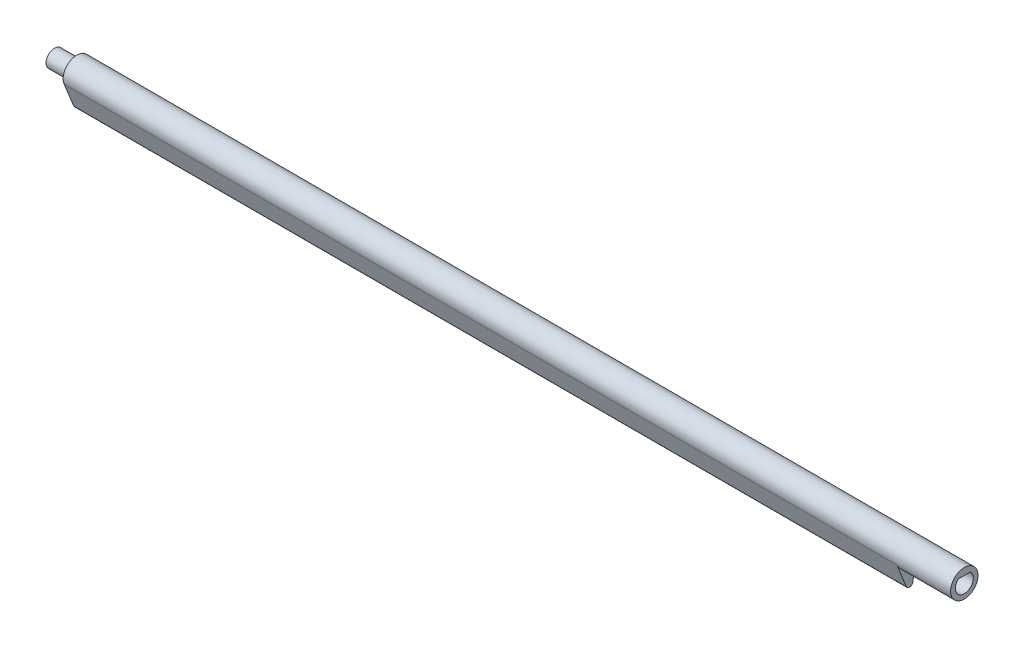
ISO-10303-21;
HEADER;
FILE_DESCRIPTION(('STEP AP214'),'2;1');
FILE_NAME('part.step','',(''),(''),'','','');
FILE_SCHEMA(('AUTOMOTIVE_DESIGN { 1 0 10303 214 1 1 1 1 }'));
ENDSEC;
DATA;
#1=APPLICATION_CONTEXT('core data for automotive mechanical design processes');
#2=APPLICATION_PROTOCOL_DEFINITION('international standard','automotive_design',2000,#1);
#3=PRODUCT_CONTEXT('',#1,'mechanical');
#4=PRODUCT('Part','Part','',(#3));
#5=PRODUCT_RELATED_PRODUCT_CATEGORY('part','',(#4));
#6=PRODUCT_DEFINITION_FORMATION('','',#4);
#7=PRODUCT_DEFINITION_CONTEXT('part definition',#1,'design');
#8=PRODUCT_DEFINITION('design','',#6,#7);
#9=PRODUCT_DEFINITION_SHAPE('','',#8);
#10=(LENGTH_UNIT() NAMED_UNIT(*) SI_UNIT(.MILLI.,.METRE.));
#11=(NAMED_UNIT(*) PLANE_ANGLE_UNIT() SI_UNIT($,.RADIAN.));
#12=(NAMED_UNIT(*) SI_UNIT($,.STERADIAN.) SOLID_ANGLE_UNIT());
#13=UNCERTAINTY_MEASURE_WITH_UNIT(LENGTH_MEASURE(1.E-05),#10,'distance_accuracy_value','');
#14=(GEOMETRIC_REPRESENTATION_CONTEXT(3) GLOBAL_UNCERTAINTY_ASSIGNED_CONTEXT((#13)) GLOBAL_UNIT_ASSIGNED_CONTEXT((#10,
#11,#12)) REPRESENTATION_CONTEXT('',''));
#15=CARTESIAN_POINT('',(0.,0.,0.));
#16=DIRECTION('',(0.,0.,1.));
#17=DIRECTION('',(1.,0.,0.));
#18=AXIS2_PLACEMENT_3D('',#15,#16,#17);
#19=CARTESIAN_POINT('',(121.5,8.00000000000002,0.));
#20=DIRECTION('',(-1.,0.,0.));
#21=DIRECTION('',(0.,0.,1.));
#22=AXIS2_PLACEMENT_3D('',#19,#20,#21);
#23=PLANE('',#22);
#24=CARTESIAN_POINT('',(121.5,8.00000000000002,0.));
#25=DIRECTION('',(-1.,0.,0.));
#26=DIRECTION('',(0.,0.,1.));
#27=AXIS2_PLACEMENT_3D('',#24,#25,#26);
#28=CIRCLE('',#27,2.625);
#29=CARTESIAN_POINT('',(121.5,9.975,1.72916164657908));
#30=VERTEX_POINT('',#29);
#31=CARTESIAN_POINT('',(121.5,9.975,-1.72916164657907));
#32=VERTEX_POINT('',#31);
#33=EDGE_CURVE('E20',#30,#32,#28,.F.);
#34=ORIENTED_EDGE('',*,*,#33,.T.);
#35=DIRECTION('',(0.,0.,-1.));
#36=VECTOR('',#35,1.);
#37=CARTESIAN_POINT('',(121.5,9.975,0.));
#38=LINE('',#37,#36);
#39=EDGE_CURVE('E92',#30,#32,#38,.T.);
#40=ORIENTED_EDGE('',*,*,#39,.F.);
#41=EDGE_LOOP('',(#34,#40));
#42=FACE_BOUND('',#41,.T.);
#43=ADVANCED_FACE('F17',(#42),#23,.F.);
#44=CARTESIAN_POINT('',(-128.,8.00000000000002,0.));
#45=DIRECTION('',(-1.,0.,0.));
#46=DIRECTION('',(0.,0.,1.));
#47=AXIS2_PLACEMENT_3D('',#44,#45,#46);
#48=PLANE('',#47);
#49=CARTESIAN_POINT('',(-128.,8.00000000000002,0.));
#50=DIRECTION('',(1.,0.,0.));
#51=DIRECTION('',(0.,0.,-1.));
#52=AXIS2_PLACEMENT_3D('',#49,#50,#51);
#53=CIRCLE('',#52,2.5);
#54=CARTESIAN_POINT('',(-128.,8.00000000000002,-2.49999999999999));
#55=VERTEX_POINT('',#54);
#56=EDGE_CURVE('E91',#55,#55,#53,.T.);
#57=ORIENTED_EDGE('',*,*,#56,.F.);
#58=EDGE_LOOP('',(#57));
#59=FACE_BOUND('',#58,.T.);
#60=ADVANCED_FACE('F239',(#59),#48,.T.);
#61=CARTESIAN_POINT('',(117.981122338017,9.975,0.));
#62=DIRECTION('',(0.,-1.,0.));
#63=DIRECTION('',(0.,0.,-1.));
#64=AXIS2_PLACEMENT_3D('',#61,#62,#63);
#65=PLANE('',#64);
#66=DIRECTION('',(-1.,0.,0.));
#67=VECTOR('',#66,1.);
#68=CARTESIAN_POINT('',(137.5,9.97500000000001,-1.72916164657907));
#69=LINE('',#68,#67);
#70=CARTESIAN_POINT('',(137.5,9.975,-1.72916164657907));
#71=VERTEX_POINT('',#70);
#72=EDGE_CURVE('E90',#32,#71,#69,.F.);
#73=ORIENTED_EDGE('',*,*,#72,.T.);
#74=DIRECTION('',(0.,0.,-1.));
#75=VECTOR('',#74,1.);
#76=CARTESIAN_POINT('',(137.5,9.975,0.));
#77=LINE('',#76,#75);
#78=CARTESIAN_POINT('',(137.5,9.975,1.72916164657908));
#79=VERTEX_POINT('',#78);
#80=EDGE_CURVE('E97',#79,#71,#77,.T.);
#81=ORIENTED_EDGE('',*,*,#80,.F.);
#82=DIRECTION('',(1.,0.,0.));
#83=VECTOR('',#82,1.);
#84=CARTESIAN_POINT('',(117.981122338017,9.975,1.72916164657907));
#85=LINE('',#84,#83);
#86=EDGE_CURVE('E87',#79,#30,#85,.F.);
#87=ORIENTED_EDGE('',*,*,#86,.T.);
#88=ORIENTED_EDGE('',*,*,#39,.T.);
#89=EDGE_LOOP('',(#73,#81,#87,#88));
#90=FACE_BOUND('',#89,.T.);
#91=ADVANCED_FACE('F95',(#90),#65,.T.);
#92=CARTESIAN_POINT('',(137.5,8.00000000000002,0.));
#93=DIRECTION('',(-1.,0.,0.));
#94=DIRECTION('',(0.,0.,1.));
#95=AXIS2_PLACEMENT_3D('',#92,#93,#94);
#96=CYLINDRICAL_SURFACE('',#95,2.625);
#97=CARTESIAN_POINT('',(137.5,8.00000000000002,0.));
#98=DIRECTION('',(-1.,0.,0.));
#99=DIRECTION('',(0.,0.,1.));
#100=AXIS2_PLACEMENT_3D('',#97,#98,#99);
#101=CIRCLE('',#100,2.625);
#102=EDGE_CURVE('E146',#71,#79,#101,.T.);
#103=ORIENTED_EDGE('',*,*,#102,.F.);
#104=ORIENTED_EDGE('',*,*,#72,.F.);
#105=ORIENTED_EDGE('',*,*,#33,.F.);
#106=ORIENTED_EDGE('',*,*,#86,.F.);
#107=EDGE_LOOP('',(#103,#104,#105,#106));
#108=FACE_BOUND('',#107,.T.);
#109=ADVANCED_FACE('F85',(#108),#96,.F.);
#110=CARTESIAN_POINT('',(-128.,8.00000000000002,0.));
#111=DIRECTION('',(1.,0.,0.));
#112=DIRECTION('',(0.,0.,-1.));
#113=AXIS2_PLACEMENT_3D('',#110,#111,#112);
#114=CYLINDRICAL_SURFACE('',#113,2.5);
#115=CARTESIAN_POINT('',(-121.5,8.00000000000002,0.));
#116=DIRECTION('',(1.,0.,0.));
#117=DIRECTION('',(0.,0.,-1.));
#118=AXIS2_PLACEMENT_3D('',#115,#116,#117);
#119=CIRCLE('',#118,2.5);
#120=CARTESIAN_POINT('',(-121.5,8.00000000000002,-2.49999999999999));
#121=VERTEX_POINT('',#120);
#122=EDGE_CURVE('E183',#121,#121,#119,.T.);
#123=ORIENTED_EDGE('',*,*,#122,.F.);
#124=EDGE_LOOP('',(#123));
#125=FACE_BOUND('',#124,.T.);
#126=ORIENTED_EDGE('',*,*,#56,.T.);
#127=EDGE_LOOP('',(#126));
#128=FACE_BOUND('',#127,.T.);
#129=ADVANCED_FACE('F225',(#125,#128),#114,.T.);
#130=CARTESIAN_POINT('',(121.5,0.,0.));
#131=DIRECTION('',(-1.,0.,0.));
#132=DIRECTION('',(0.,0.,1.));
#133=AXIS2_PLACEMENT_3D('',#130,#131,#132);
#134=CYLINDRICAL_SURFACE('',#133,1.);
#135=CARTESIAN_POINT('',(121.5,0.,0.));
#136=DIRECTION('',(-1.,0.,0.));
#137=DIRECTION('',(0.,0.,1.));
#138=AXIS2_PLACEMENT_3D('',#135,#136,#137);
#139=CIRCLE('',#138,1.);
#140=CARTESIAN_POINT('',(121.5,-0.155855908360178,-0.987779801286301));
#141=VERTEX_POINT('',#140);
#142=CARTESIAN_POINT('',(121.5,-0.375000000000003,0.927024810886965));
#143=VERTEX_POINT('',#142);
#144=EDGE_CURVE('E163',#141,#143,#139,.T.);
#145=ORIENTED_EDGE('',*,*,#144,.T.);
#146=DIRECTION('',(1.,0.,0.));
#147=VECTOR('',#146,1.);
#148=CARTESIAN_POINT('',(121.5,-0.375000000000005,0.92702481088697));
#149=LINE('',#148,#147);
#150=CARTESIAN_POINT('',(-121.5,-0.375000000000003,0.927024810886965));
#151=VERTEX_POINT('',#150);
#152=EDGE_CURVE('E173',#143,#151,#149,.F.);
#153=ORIENTED_EDGE('',*,*,#152,.T.);
#154=CARTESIAN_POINT('',(-121.5,0.,0.));
#155=DIRECTION('',(-1.,0.,0.));
#156=DIRECTION('',(0.,0.,1.));
#157=AXIS2_PLACEMENT_3D('',#154,#155,#156);
#158=CIRCLE('',#157,1.);
#159=CARTESIAN_POINT('',(-121.5,-0.155855908360177,-0.987779801286307));
#160=VERTEX_POINT('',#159);
#161=EDGE_CURVE('E168',#160,#151,#158,.T.);
#162=ORIENTED_EDGE('',*,*,#161,.F.);
#163=DIRECTION('',(1.,0.,0.));
#164=VECTOR('',#163,1.);
#165=CARTESIAN_POINT('',(121.5,-0.155855908360174,-0.987779801286301));
#166=LINE('',#165,#164);
#167=EDGE_CURVE('E160',#160,#141,#166,.T.);
#168=ORIENTED_EDGE('',*,*,#167,.T.);
#169=EDGE_LOOP('',(#145,#153,#162,#168));
#170=FACE_BOUND('',#169,.T.);
#171=ADVANCED_FACE('F223',(#170),#134,.T.);
#172=CARTESIAN_POINT('',(121.5,6.49999999999999,3.70809924354784));
#173=DIRECTION('',(0.,0.375,-0.927024810886958));
#174=DIRECTION('',(0.,0.927024810886958,0.375));
#175=AXIS2_PLACEMENT_3D('',#172,#173,#174);
#176=PLANE('',#175);
#177=ORIENTED_EDGE('',*,*,#152,.F.);
#178=DIRECTION('',(0.,0.927024810886957,0.375000000000001));
#179=VECTOR('',#178,1.);
#180=CARTESIAN_POINT('',(121.5,-0.375,0.92702481088696));
#181=LINE('',#180,#179);
#182=CARTESIAN_POINT('',(121.5,6.5,3.70809924354784));
#183=VERTEX_POINT('',#182);
#184=EDGE_CURVE('E161',#143,#183,#181,.T.);
#185=ORIENTED_EDGE('',*,*,#184,.T.);
#186=DIRECTION('',(-1.,0.,0.));
#187=VECTOR('',#186,1.);
#188=CARTESIAN_POINT('',(121.5,6.5,3.70809924354783));
#189=LINE('',#188,#187);
#190=CARTESIAN_POINT('',(-121.5,6.5,3.70809924354784));
#191=VERTEX_POINT('',#190);
#192=EDGE_CURVE('E164',#191,#183,#189,.F.);
#193=ORIENTED_EDGE('',*,*,#192,.F.);
#194=DIRECTION('',(0.,0.927024810886957,0.375000000000001));
#195=VECTOR('',#194,1.);
#196=CARTESIAN_POINT('',(-121.5,-0.375,0.92702481088696));
#197=LINE('',#196,#195);
#198=EDGE_CURVE('E186',#151,#191,#197,.T.);
#199=ORIENTED_EDGE('',*,*,#198,.F.);
#200=EDGE_LOOP('',(#177,#185,#193,#199));
#201=FACE_BOUND('',#200,.T.);
#202=ADVANCED_FACE('F218',(#201),#176,.F.);
#203=CARTESIAN_POINT('',(121.5,8.00000000000002,0.));
#204=DIRECTION('',(-1.,0.,0.));
#205=DIRECTION('',(0.,0.,1.));
#206=AXIS2_PLACEMENT_3D('',#203,#204,#205);
#207=PLANE('',#206);
#208=ORIENTED_EDGE('',*,*,#184,.F.);
#209=ORIENTED_EDGE('',*,*,#144,.F.);
#210=DIRECTION('',(0.,-0.98777980128631,0.155855908360183));
#211=VECTOR('',#210,1.);
#212=CARTESIAN_POINT('',(121.5,6.25936875179671,-1.99999999999999));
#213=LINE('',#212,#211);
#214=CARTESIAN_POINT('',(121.5,4.38092441125769,-1.70361142370241));
#215=VERTEX_POINT('',#214);
#216=EDGE_CURVE('E158',#141,#215,#213,.F.);
#217=ORIENTED_EDGE('',*,*,#216,.T.);
#218=CARTESIAN_POINT('',(121.5,8.00000000000002,0.));
#219=DIRECTION('',(-1.,0.,0.));
#220=DIRECTION('',(0.,0.,1.));
#221=AXIS2_PLACEMENT_3D('',#218,#219,#220);
#222=CIRCLE('',#221,4.);
#223=EDGE_CURVE('E167',#183,#215,#222,.F.);
#224=ORIENTED_EDGE('',*,*,#223,.F.);
#225=EDGE_LOOP('',(#208,#209,#217,#224));
#226=FACE_BOUND('',#225,.T.);
#227=ADVANCED_FACE('F222',(#226),#207,.F.);
#228=CARTESIAN_POINT('',(121.5,6.25936875179671,-1.99999999999999));
#229=DIRECTION('',(0.,0.155855908360183,0.98777980128631));
#230=DIRECTION('',(0.,-0.98777980128631,0.155855908360183));
#231=AXIS2_PLACEMENT_3D('',#228,#229,#230);
#232=PLANE('',#231);
#233=DIRECTION('',(0.,-0.98777980128631,0.155855908360183));
#234=VECTOR('',#233,1.);
#235=CARTESIAN_POINT('',(119.5,7.64981557827362,-2.21939034680085));
#236=LINE('',#235,#234);
#237=CARTESIAN_POINT('',(119.5,6.25936875179669,-1.99999999999999));
#238=VERTEX_POINT('',#237);
#239=CARTESIAN_POINT('',(119.5,4.3809244112577,-1.70361142370241));
#240=VERTEX_POINT('',#239);
#241=EDGE_CURVE('E151',#238,#240,#236,.T.);
#242=ORIENTED_EDGE('',*,*,#241,.T.);
#243=DIRECTION('',(-1.,0.,0.));
#244=VECTOR('',#243,1.);
#245=CARTESIAN_POINT('',(121.5,4.38092441125769,-1.70361142370241));
#246=LINE('',#245,#244);
#247=EDGE_CURVE('E190',#215,#240,#246,.T.);
#248=ORIENTED_EDGE('',*,*,#247,.F.);
#249=ORIENTED_EDGE('',*,*,#216,.F.);
#250=ORIENTED_EDGE('',*,*,#167,.F.);
#251=DIRECTION('',(0.,-0.98777980128631,0.155855908360181));
#252=VECTOR('',#251,1.);
#253=CARTESIAN_POINT('',(-121.5,6.25936875179671,-1.99999999999999));
#254=LINE('',#253,#252);
#255=CARTESIAN_POINT('',(-121.5,6.25936875179671,-1.99999999999999));
#256=VERTEX_POINT('',#255);
#257=EDGE_CURVE('E188',#256,#160,#254,.T.);
#258=ORIENTED_EDGE('',*,*,#257,.F.);
#259=DIRECTION('',(1.,0.,0.));
#260=VECTOR('',#259,1.);
#261=CARTESIAN_POINT('',(121.5,6.2593687517967,-2.));
#262=LINE('',#261,#260);
#263=EDGE_CURVE('E149',#256,#238,#262,.T.);
#264=ORIENTED_EDGE('',*,*,#263,.T.);
#265=EDGE_LOOP('',(#242,#248,#249,#250,#258,#264));
#266=FACE_BOUND('',#265,.T.);
#267=ADVANCED_FACE('F213',(#266),#232,.F.);
#268=CARTESIAN_POINT('',(119.5,7.33810376155325,-4.19494994937347));
#269=DIRECTION('',(0.,-0.98777980128631,0.155855908360183));
#270=DIRECTION('',(0.,-0.155855908360183,-0.98777980128631));
#271=AXIS2_PLACEMENT_3D('',#268,#269,#270);
#272=CYLINDRICAL_SURFACE('',#271,2.);
#273=ORIENTED_EDGE('',*,*,#241,.F.);
#274=CARTESIAN_POINT('',(119.5,5.22861204372113,-3.86210577961735));
#275=DIRECTION('',(0.,-0.874903530114614,0.484297236202093));
#276=DIRECTION('',(0.,0.484297236202094,0.874903530114614));
#277=AXIS2_PLACEMENT_3D('',#274,#275,#276);
#278=ELLIPSE('',#277,2.12835554495182,2.);
#279=CARTESIAN_POINT('',(121.368239865601,5.59655025011659,-3.19740977977257));
#280=VERTEX_POINT('',#279);
#281=EDGE_CURVE('E147',#238,#280,#278,.F.);
#282=ORIENTED_EDGE('',*,*,#281,.T.);
#283=CARTESIAN_POINT('',(119.5,4.3809244112577,-1.70361142370241));
#284=CARTESIAN_POINT('',(119.547205095446,4.38092791234532,-1.70360383633558));
#285=CARTESIAN_POINT('',(119.594407739188,4.38178487283567,-1.70543895437199));
#286=CARTESIAN_POINT('',(119.688463518976,4.38523028822923,-1.71273750755915));
#287=CARTESIAN_POINT('',(119.735316689154,4.38781857174991,-1.7182005835803));
#288=CARTESIAN_POINT('',(119.828243263005,4.39474410972542,-1.73268315354701));
#289=CARTESIAN_POINT('',(119.874318065595,4.39907777600595,-1.74169535033837));
#290=CARTESIAN_POINT('',(119.965440555171,4.40953514484708,-1.76315156202008));
#291=CARTESIAN_POINT('',(120.010488250796,4.41565883234453,-1.77559554803165));
#292=CARTESIAN_POINT('',(120.143640880581,4.43680589783463,-1.81787102939091));
#293=CARTESIAN_POINT('',(120.229807006725,4.45460895114168,-1.85265427740349));
#294=CARTESIAN_POINT('',(120.394410789971,4.49807373190417,-1.93354680492804));
#295=CARTESIAN_POINT('',(120.472848824285,4.52373507554155,-1.97965553125428));
#296=CARTESIAN_POINT('',(120.621189750497,4.5836302693388,-2.08132805318016));
#297=CARTESIAN_POINT('',(120.690980518793,4.6179620755218,-2.13699739066208));
#298=CARTESIAN_POINT('',(120.819901400326,4.69506416992994,-2.25440124987734));
#299=CARTESIAN_POINT('',(120.879031757524,4.73783426500132,-2.31613563276459));
#300=CARTESIAN_POINT('',(120.991059831836,4.8354070864309,-2.44798175546363));
#301=CARTESIAN_POINT('',(121.043019045596,4.89091808855567,-2.51836187341093));
#302=CARTESIAN_POINT('',(121.135271642388,5.01071113084228,-2.65946333605323));
#303=CARTESIAN_POINT('',(121.175541949925,5.07501015681404,-2.7301850792401));
#304=CARTESIAN_POINT('',(121.246168677582,5.21186021805592,-2.86982836484515));
#305=CARTESIAN_POINT('',(121.27643616678,5.28447793162928,-2.9387289975788));
#306=CARTESIAN_POINT('',(121.315360245051,5.39820516355079,-3.03861922725383));
#307=CARTESIAN_POINT('',(121.327236066643,5.43682283167749,-3.07127012416033));
#308=CARTESIAN_POINT('',(121.349095677774,5.51557316024571,-3.13531458714131));
#309=CARTESIAN_POINT('',(121.359080418403,5.55570504689073,-3.16670877895619));
#310=CARTESIAN_POINT('',(121.368239865601,5.59655025011659,-3.19740977977256));
#311=B_SPLINE_CURVE_WITH_KNOTS('',3,(#283,#284,#285,#286,#287,#288,#289,#290,#291,#292,#293,
#294,#295,#296,#297,#298,#299,#300,#301,#302,#303,#304,#305,#306,#307,#308,#309,#310),
.UNSPECIFIED.,.F.,.F.,(4,2,2,2,2,2,2,2,2,2,2,2,2,4),(0.,0.14156753206199,0.283121052519576,
0.424385039354118,0.56564783747657,0.848018160166675,1.13037469340091,1.41607627414079,
1.70177131588478,2.01142474284935,2.32168537386685,2.63463451568903,2.79041510676952,
2.94611714123886),.UNSPECIFIED.);
#312=EDGE_CURVE('E113',#240,#280,#311,.T.);
#313=ORIENTED_EDGE('',*,*,#312,.F.);
#314=EDGE_LOOP('',(#273,#282,#313));
#315=FACE_BOUND('',#314,.T.);
#316=ADVANCED_FACE('F141',(#315),#272,.F.);
#317=CARTESIAN_POINT('',(119.5,4.51048880407669,-3.03697611428967));
#318=DIRECTION('',(0.,-0.656500981010179,0.754325169892052));
#319=DIRECTION('',(0.,-0.754325169892052,-0.656500981010179));
#320=AXIS2_PLACEMENT_3D('',#317,#318,#319);
#321=CYLINDRICAL_SURFACE('',#320,2.);
#322=DIRECTION('',(0.,-0.656500981010179,0.754325169892052));
#323=VECTOR('',#322,1.);
#324=CARTESIAN_POINT('',(119.5,7.99999999999999,-4.));
#325=LINE('',#324,#323);
#326=CARTESIAN_POINT('',(119.5,8.,-4.));
#327=VERTEX_POINT('',#326);
#328=EDGE_CURVE('E155',#238,#327,#325,.F.);
#329=ORIENTED_EDGE('',*,*,#328,.T.);
#330=CARTESIAN_POINT('',(121.368239865601,5.5965502501166,-3.19740977977257));
#331=CARTESIAN_POINT('',(121.361533996209,5.66355901869238,-3.24779414934075));
#332=CARTESIAN_POINT('',(121.353618629068,5.73210348654984,-3.29600607022832));
#333=CARTESIAN_POINT('',(121.334714187342,5.87187146548005,-3.3879271823919));
#334=CARTESIAN_POINT('',(121.323720956215,5.94309848587274,-3.43163017453638));
#335=CARTESIAN_POINT('',(121.297899380211,6.08833755294341,-3.51462786245362));
#336=CARTESIAN_POINT('',(121.283035784343,6.16236955375444,-3.55387701018586));
#337=CARTESIAN_POINT('',(121.24870346748,6.31182575736151,-3.62725808743738));
#338=CARTESIAN_POINT('',(121.229237601708,6.38724907035316,-3.66139316833237));
#339=CARTESIAN_POINT('',(121.173617720703,6.5766247903377,-3.74020039680575));
#340=CARTESIAN_POINT('',(121.133986786993,6.69097676511671,-3.78160145529381));
#341=CARTESIAN_POINT('',(121.038991156966,6.91646896576045,-3.85224977398837));
#342=CARTESIAN_POINT('',(120.983692324278,7.02762053488775,-3.88154667558357));
#343=CARTESIAN_POINT('',(120.866963799193,7.22067791386959,-3.92434653609681));
#344=CARTESIAN_POINT('',(120.808769741694,7.30409156642588,-3.93980522712393));
#345=CARTESIAN_POINT('',(120.679584917596,7.46155196608834,-3.96439391707808));
#346=CARTESIAN_POINT('',(120.608594194146,7.53559874477813,-3.97352393734487));
#347=CARTESIAN_POINT('',(120.453863540367,7.67081571803194,-3.98701766165955));
#348=CARTESIAN_POINT('',(120.370036867545,7.7318909912647,-3.99134714726968));
#349=CARTESIAN_POINT('',(120.192139065538,7.83686373145392,-3.99702111372594));
#350=CARTESIAN_POINT('',(120.09807454183,7.88077219145752,-3.99836750743019));
#351=CARTESIAN_POINT('',(119.920368991004,7.94283132461821,-3.99968976311321));
#352=CARTESIAN_POINT('',(119.837839209228,7.96416963717463,-3.99986638894983));
#353=CARTESIAN_POINT('',(119.71221105441,7.9856139183692,-3.99997985517789));
#354=CARTESIAN_POINT('',(119.669962884095,7.99100159375222,-3.99999233360894));
#355=CARTESIAN_POINT('',(119.585149190158,7.99819623648075,-4.00000037353617));
#356=CARTESIAN_POINT('',(119.542583568925,8.00000205269184,-3.99999592959518));
#357=CARTESIAN_POINT('',(119.5,7.99999999999999,-3.99999999999999));
#358=B_SPLINE_CURVE_WITH_KNOTS('',3,(#330,#331,#332,#333,#334,#335,#336,#337,#338,#339,#340,
#341,#342,#343,#344,#345,#346,#347,#348,#349,#350,#351,#352,#353,#354,#355,#356,#357),
.UNSPECIFIED.,.F.,.F.,(4,2,2,2,2,2,2,2,2,2,2,2,2,4),(0.,0.252293246873263,0.504928863721803,
0.759951252605226,1.01481584017002,1.39717590420562,1.77795188841265,2.0853413708562,
2.3927298168032,2.70229553134186,3.01166268448981,3.26614687012018,3.39378302227299,
3.52146018736609),.UNSPECIFIED.);
#359=EDGE_CURVE('E105',#280,#327,#358,.T.);
#360=ORIENTED_EDGE('',*,*,#359,.F.);
#361=ORIENTED_EDGE('',*,*,#281,.F.);
#362=EDGE_LOOP('',(#329,#360,#361));
#363=FACE_BOUND('',#362,.T.);
#364=ADVANCED_FACE('F119',(#363),#321,.F.);
#365=CARTESIAN_POINT('',(137.5,8.00000000000002,0.));
#366=DIRECTION('',(1.,0.,0.));
#367=DIRECTION('',(0.,0.,-1.));
#368=AXIS2_PLACEMENT_3D('',#365,#366,#367);
#369=PLANE('',#368);
#370=ORIENTED_EDGE('',*,*,#80,.T.);
#371=ORIENTED_EDGE('',*,*,#102,.T.);
#372=EDGE_LOOP('',(#370,#371));
#373=FACE_BOUND('',#372,.T.);
#374=CARTESIAN_POINT('',(137.5,8.00000000000002,0.));
#375=DIRECTION('',(-1.,0.,0.));
#376=DIRECTION('',(0.,0.,1.));
#377=AXIS2_PLACEMENT_3D('',#374,#375,#376);
#378=CIRCLE('',#377,4.);
#379=CARTESIAN_POINT('',(137.5,8.00000000000002,4.00000000000001));
#380=VERTEX_POINT('',#379);
#381=EDGE_CURVE('E102',#380,#380,#378,.T.);
#382=ORIENTED_EDGE('',*,*,#381,.F.);
#383=EDGE_LOOP('',(#382));
#384=FACE_BOUND('',#383,.T.);
#385=ADVANCED_FACE('F134',(#373,#384),#369,.T.);
#386=CARTESIAN_POINT('',(121.5,7.99999999999999,-4.));
#387=DIRECTION('',(0.,0.754325169892052,0.656500981010179));
#388=DIRECTION('',(0.,-0.656500981010179,0.754325169892052));
#389=AXIS2_PLACEMENT_3D('',#386,#387,#388);
#390=PLANE('',#389);
#391=ORIENTED_EDGE('',*,*,#328,.F.);
#392=ORIENTED_EDGE('',*,*,#263,.F.);
#393=DIRECTION('',(0.,-0.656500981010176,0.754325169892055));
#394=VECTOR('',#393,1.);
#395=CARTESIAN_POINT('',(-121.5,7.99999999999999,-4.));
#396=LINE('',#395,#394);
#397=CARTESIAN_POINT('',(-121.5,7.99999999999999,-3.99999999999999));
#398=VERTEX_POINT('',#397);
#399=EDGE_CURVE('E35',#398,#256,#396,.T.);
#400=ORIENTED_EDGE('',*,*,#399,.F.);
#401=DIRECTION('',(-1.,0.,0.));
#402=VECTOR('',#401,1.);
#403=CARTESIAN_POINT('',(121.5,7.99999999999999,-3.99999999999999));
#404=LINE('',#403,#402);
#405=EDGE_CURVE('E26',#327,#398,#404,.T.);
#406=ORIENTED_EDGE('',*,*,#405,.F.);
#407=EDGE_LOOP('',(#391,#392,#400,#406));
#408=FACE_BOUND('',#407,.T.);
#409=ADVANCED_FACE('F131',(#408),#390,.F.);
#410=CARTESIAN_POINT('',(-121.5,8.00000000000002,0.));
#411=DIRECTION('',(-1.,0.,0.));
#412=DIRECTION('',(0.,0.,1.));
#413=AXIS2_PLACEMENT_3D('',#410,#411,#412);
#414=PLANE('',#413);
#415=ORIENTED_EDGE('',*,*,#257,.T.);
#416=ORIENTED_EDGE('',*,*,#161,.T.);
#417=ORIENTED_EDGE('',*,*,#198,.T.);
#418=CARTESIAN_POINT('',(-121.5,8.00000000000002,0.));
#419=DIRECTION('',(-1.,0.,0.));
#420=DIRECTION('',(0.,0.,1.));
#421=AXIS2_PLACEMENT_3D('',#418,#419,#420);
#422=CIRCLE('',#421,4.);
#423=EDGE_CURVE('E11',#398,#191,#422,.F.);
#424=ORIENTED_EDGE('',*,*,#423,.F.);
#425=ORIENTED_EDGE('',*,*,#399,.T.);
#426=EDGE_LOOP('',(#415,#416,#417,#424,#425));
#427=FACE_BOUND('',#426,.T.);
#428=ORIENTED_EDGE('',*,*,#122,.T.);
#429=EDGE_LOOP('',(#428));
#430=FACE_BOUND('',#429,.T.);
#431=ADVANCED_FACE('F126',(#427,#430),#414,.T.);
#432=CARTESIAN_POINT('',(121.5,8.00000000000002,0.));
#433=DIRECTION('',(-1.,0.,0.));
#434=DIRECTION('',(0.,0.,1.));
#435=AXIS2_PLACEMENT_3D('',#432,#433,#434);
#436=CYLINDRICAL_SURFACE('',#435,4.);
#437=ORIENTED_EDGE('',*,*,#359,.T.);
#438=ORIENTED_EDGE('',*,*,#405,.T.);
#439=ORIENTED_EDGE('',*,*,#423,.T.);
#440=ORIENTED_EDGE('',*,*,#192,.T.);
#441=ORIENTED_EDGE('',*,*,#223,.T.);
#442=ORIENTED_EDGE('',*,*,#247,.T.);
#443=ORIENTED_EDGE('',*,*,#312,.T.);
#444=EDGE_LOOP('',(#437,#438,#439,#440,#441,#442,#443));
#445=FACE_BOUND('',#444,.T.);
#446=ORIENTED_EDGE('',*,*,#381,.T.);
#447=EDGE_LOOP('',(#446));
#448=FACE_BOUND('',#447,.T.);
#449=ADVANCED_FACE('F122',(#445,#448),#436,.T.);
#450=CLOSED_SHELL('',(#43,#60,#91,#109,#129,#171,#202,#227,#267,#316,#364,#385,#409,#431,#449));
#451=MANIFOLD_SOLID_BREP('B1',#450);
#452=ADVANCED_BREP_SHAPE_REPRESENTATION('',(#18,#451),#14);
#453=SHAPE_DEFINITION_REPRESENTATION(#9,#452);
ENDSEC;
END-ISO-10303-21;
